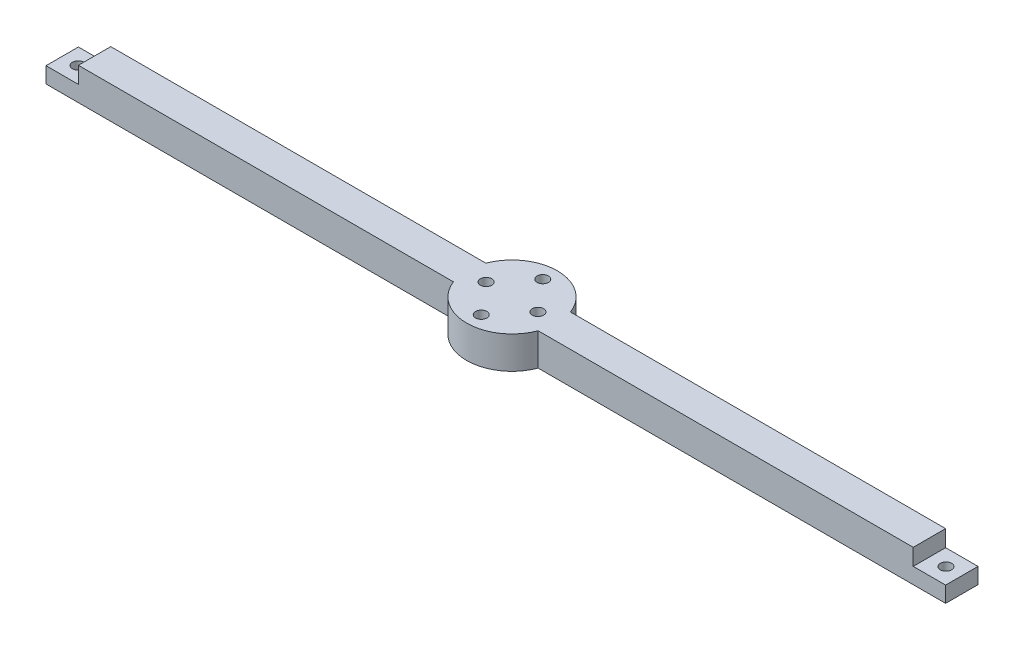
ISO-10303-21;
HEADER;
FILE_DESCRIPTION(('STEP AP214'),'2;1');
FILE_NAME('part.step','',(''),(''),'','','');
FILE_SCHEMA(('AUTOMOTIVE_DESIGN { 1 0 10303 214 1 1 1 1 }'));
ENDSEC;
DATA;
#1=APPLICATION_CONTEXT('core data for automotive mechanical design processes');
#2=APPLICATION_PROTOCOL_DEFINITION('international standard','automotive_design',2000,#1);
#3=PRODUCT_CONTEXT('',#1,'mechanical');
#4=PRODUCT('Part','Part','',(#3));
#5=PRODUCT_RELATED_PRODUCT_CATEGORY('part','',(#4));
#6=PRODUCT_DEFINITION_FORMATION('','',#4);
#7=PRODUCT_DEFINITION_CONTEXT('part definition',#1,'design');
#8=PRODUCT_DEFINITION('design','',#6,#7);
#9=PRODUCT_DEFINITION_SHAPE('','',#8);
#10=(LENGTH_UNIT() NAMED_UNIT(*) SI_UNIT(.MILLI.,.METRE.));
#11=(NAMED_UNIT(*) PLANE_ANGLE_UNIT() SI_UNIT($,.RADIAN.));
#12=(NAMED_UNIT(*) SI_UNIT($,.STERADIAN.) SOLID_ANGLE_UNIT());
#13=UNCERTAINTY_MEASURE_WITH_UNIT(LENGTH_MEASURE(1.E-05),#10,'distance_accuracy_value','');
#14=(GEOMETRIC_REPRESENTATION_CONTEXT(3) GLOBAL_UNCERTAINTY_ASSIGNED_CONTEXT((#13)) GLOBAL_UNIT_ASSIGNED_CONTEXT((#10,
#11,#12)) REPRESENTATION_CONTEXT('',''));
#15=CARTESIAN_POINT('',(0.,0.,0.));
#16=DIRECTION('',(0.,0.,1.));
#17=DIRECTION('',(1.,0.,0.));
#18=AXIS2_PLACEMENT_3D('',#15,#16,#17);
#19=CARTESIAN_POINT('',(0.,10.,0.));
#20=DIRECTION('',(0.,-1.,0.));
#21=DIRECTION('',(0.,0.,-1.));
#22=AXIS2_PLACEMENT_3D('',#19,#20,#21);
#23=CYLINDRICAL_SURFACE('',#22,14.);
#24=CARTESIAN_POINT('',(0.,0.,0.));
#25=DIRECTION('',(0.,1.,0.));
#26=DIRECTION('',(0.,0.,1.));
#27=AXIS2_PLACEMENT_3D('',#24,#25,#26);
#28=CIRCLE('',#27,14.);
#29=CARTESIAN_POINT('',(13.076696830622,0.,-5.));
#30=VERTEX_POINT('',#29);
#31=CARTESIAN_POINT('',(-13.076696830622,0.,-5.));
#32=VERTEX_POINT('',#31);
#33=EDGE_CURVE('E231',#30,#32,#28,.T.);
#34=ORIENTED_EDGE('',*,*,#33,.T.);
#35=DIRECTION('',(0.,1.,0.));
#36=VECTOR('',#35,1.);
#37=CARTESIAN_POINT('',(-13.076696830622,-136.29066125188,-5.));
#38=LINE('',#37,#36);
#39=CARTESIAN_POINT('',(-13.076696830622,10.,-5.));
#40=VERTEX_POINT('',#39);
#41=EDGE_CURVE('E158',#32,#40,#38,.T.);
#42=ORIENTED_EDGE('',*,*,#41,.T.);
#43=CARTESIAN_POINT('',(0.,10.,0.));
#44=DIRECTION('',(0.,1.,0.));
#45=DIRECTION('',(0.,0.,1.));
#46=AXIS2_PLACEMENT_3D('',#43,#44,#45);
#47=CIRCLE('',#46,14.);
#48=CARTESIAN_POINT('',(13.076696830622,10.,-5.));
#49=VERTEX_POINT('',#48);
#50=EDGE_CURVE('E151',#49,#40,#47,.T.);
#51=ORIENTED_EDGE('',*,*,#50,.F.);
#52=DIRECTION('',(0.,1.,0.));
#53=VECTOR('',#52,1.);
#54=CARTESIAN_POINT('',(13.076696830622,-136.29066125188,-5.));
#55=LINE('',#54,#53);
#56=EDGE_CURVE('E216',#30,#49,#55,.T.);
#57=ORIENTED_EDGE('',*,*,#56,.F.);
#58=EDGE_LOOP('',(#34,#42,#51,#57));
#59=FACE_BOUND('',#58,.T.);
#60=ADVANCED_FACE('F39',(#59),#23,.T.);
#61=CARTESIAN_POINT('',(-13.076696830622,10.,5.));
#62=VERTEX_POINT('',#61);
#63=CARTESIAN_POINT('',(13.076696830622,10.,5.));
#64=VERTEX_POINT('',#63);
#65=EDGE_CURVE('E230',#62,#64,#47,.T.);
#66=ORIENTED_EDGE('',*,*,#65,.F.);
#67=DIRECTION('',(0.,1.,0.));
#68=VECTOR('',#67,1.);
#69=CARTESIAN_POINT('',(-13.076696830622,-136.29066125188,5.));
#70=LINE('',#69,#68);
#71=CARTESIAN_POINT('',(-13.076696830622,0.,5.));
#72=VERTEX_POINT('',#71);
#73=EDGE_CURVE('E153',#72,#62,#70,.T.);
#74=ORIENTED_EDGE('',*,*,#73,.F.);
#75=CARTESIAN_POINT('',(13.076696830622,0.,5.));
#76=VERTEX_POINT('',#75);
#77=EDGE_CURVE('E226',#72,#76,#28,.T.);
#78=ORIENTED_EDGE('',*,*,#77,.T.);
#79=DIRECTION('',(0.,1.,0.));
#80=VECTOR('',#79,1.);
#81=CARTESIAN_POINT('',(13.076696830622,-136.29066125188,5.));
#82=LINE('',#81,#80);
#83=EDGE_CURVE('E209',#76,#64,#82,.T.);
#84=ORIENTED_EDGE('',*,*,#83,.T.);
#85=EDGE_LOOP('',(#66,#74,#78,#84));
#86=FACE_BOUND('',#85,.T.);
#87=ADVANCED_FACE('F41',(#86),#23,.T.);
#88=CARTESIAN_POINT('',(0.,10.,0.));
#89=DIRECTION('',(0.,1.,0.));
#90=DIRECTION('',(0.,0.,1.));
#91=AXIS2_PLACEMENT_3D('',#88,#89,#90);
#92=PLANE('',#91);
#93=CARTESIAN_POINT('',(0.,10.,-9.5));
#94=DIRECTION('',(0.,1.,0.));
#95=DIRECTION('',(0.,0.,1.));
#96=AXIS2_PLACEMENT_3D('',#93,#94,#95);
#97=CIRCLE('',#96,1.75);
#98=CARTESIAN_POINT('',(0.,10.,-7.75));
#99=VERTEX_POINT('',#98);
#100=EDGE_CURVE('E309',#99,#99,#97,.T.);
#101=ORIENTED_EDGE('',*,*,#100,.F.);
#102=EDGE_LOOP('',(#101));
#103=FACE_BOUND('',#102,.T.);
#104=CARTESIAN_POINT('',(8.,10.,0.));
#105=DIRECTION('',(0.,1.,0.));
#106=DIRECTION('',(0.,0.,1.));
#107=AXIS2_PLACEMENT_3D('',#104,#105,#106);
#108=CIRCLE('',#107,1.75);
#109=CARTESIAN_POINT('',(8.,10.,1.75));
#110=VERTEX_POINT('',#109);
#111=EDGE_CURVE('E301',#110,#110,#108,.T.);
#112=ORIENTED_EDGE('',*,*,#111,.F.);
#113=EDGE_LOOP('',(#112));
#114=FACE_BOUND('',#113,.T.);
#115=CARTESIAN_POINT('',(-8.,10.,0.));
#116=DIRECTION('',(0.,1.,0.));
#117=DIRECTION('',(0.,0.,1.));
#118=AXIS2_PLACEMENT_3D('',#115,#116,#117);
#119=CIRCLE('',#118,1.75);
#120=CARTESIAN_POINT('',(-8.,10.,1.75));
#121=VERTEX_POINT('',#120);
#122=EDGE_CURVE('E293',#121,#121,#119,.T.);
#123=ORIENTED_EDGE('',*,*,#122,.F.);
#124=EDGE_LOOP('',(#123));
#125=FACE_BOUND('',#124,.T.);
#126=CARTESIAN_POINT('',(0.,10.,9.5));
#127=DIRECTION('',(0.,1.,0.));
#128=DIRECTION('',(0.,0.,1.));
#129=AXIS2_PLACEMENT_3D('',#126,#127,#128);
#130=CIRCLE('',#129,1.75);
#131=CARTESIAN_POINT('',(0.,10.,11.25));
#132=VERTEX_POINT('',#131);
#133=EDGE_CURVE('E284',#132,#132,#130,.T.);
#134=ORIENTED_EDGE('',*,*,#133,.F.);
#135=EDGE_LOOP('',(#134));
#136=FACE_BOUND('',#135,.T.);
#137=DIRECTION('',(0.,0.,-1.));
#138=VECTOR('',#137,1.);
#139=CARTESIAN_POINT('',(-128.9,10.,14.));
#140=LINE('',#139,#138);
#141=CARTESIAN_POINT('',(-128.9,10.,5.));
#142=VERTEX_POINT('',#141);
#143=CARTESIAN_POINT('',(-128.9,10.,-5.));
#144=VERTEX_POINT('',#143);
#145=EDGE_CURVE('E126',#142,#144,#140,.T.);
#146=ORIENTED_EDGE('',*,*,#145,.F.);
#147=DIRECTION('',(1.,0.,0.));
#148=VECTOR('',#147,1.);
#149=CARTESIAN_POINT('',(-13.076696830622,10.,5.));
#150=LINE('',#149,#148);
#151=EDGE_CURVE('E63',#142,#62,#150,.T.);
#152=ORIENTED_EDGE('',*,*,#151,.T.);
#153=ORIENTED_EDGE('',*,*,#65,.T.);
#154=DIRECTION('',(1.,0.,0.));
#155=VECTOR('',#154,1.);
#156=CARTESIAN_POINT('',(13.076696830622,10.,5.));
#157=LINE('',#156,#155);
#158=CARTESIAN_POINT('',(128.9,10.,5.));
#159=VERTEX_POINT('',#158);
#160=EDGE_CURVE('E212',#64,#159,#157,.T.);
#161=ORIENTED_EDGE('',*,*,#160,.T.);
#162=DIRECTION('',(0.,0.,1.));
#163=VECTOR('',#162,1.);
#164=CARTESIAN_POINT('',(128.9,10.,-14.));
#165=LINE('',#164,#163);
#166=CARTESIAN_POINT('',(128.9,10.,-5.));
#167=VERTEX_POINT('',#166);
#168=EDGE_CURVE('E190',#167,#159,#165,.T.);
#169=ORIENTED_EDGE('',*,*,#168,.F.);
#170=DIRECTION('',(-1.,0.,0.));
#171=VECTOR('',#170,1.);
#172=CARTESIAN_POINT('',(13.076696830622,10.,-5.));
#173=LINE('',#172,#171);
#174=EDGE_CURVE('E195',#167,#49,#173,.T.);
#175=ORIENTED_EDGE('',*,*,#174,.T.);
#176=ORIENTED_EDGE('',*,*,#50,.T.);
#177=DIRECTION('',(-1.,0.,0.));
#178=VECTOR('',#177,1.);
#179=CARTESIAN_POINT('',(-13.076696830622,10.,-5.));
#180=LINE('',#179,#178);
#181=EDGE_CURVE('E142',#40,#144,#180,.T.);
#182=ORIENTED_EDGE('',*,*,#181,.T.);
#183=EDGE_LOOP('',(#146,#152,#153,#161,#169,#175,#176,#182));
#184=FACE_BOUND('',#183,.T.);
#185=ADVANCED_FACE('F149',(#103,#114,#125,#136,#184),#92,.T.);
#186=CARTESIAN_POINT('',(0.,0.,0.));
#187=DIRECTION('',(0.,1.,0.));
#188=DIRECTION('',(0.,0.,1.));
#189=AXIS2_PLACEMENT_3D('',#186,#187,#188);
#190=PLANE('',#189);
#191=CARTESIAN_POINT('',(0.,0.,0.));
#192=DIRECTION('',(0.,-1.,0.));
#193=DIRECTION('',(0.,0.,-1.));
#194=AXIS2_PLACEMENT_3D('',#191,#192,#193);
#195=CIRCLE('',#194,4.75);
#196=CARTESIAN_POINT('',(0.,0.,-4.75));
#197=VERTEX_POINT('',#196);
#198=EDGE_CURVE('E316',#197,#197,#195,.T.);
#199=ORIENTED_EDGE('',*,*,#198,.F.);
#200=EDGE_LOOP('',(#199));
#201=FACE_BOUND('',#200,.T.);
#202=CARTESIAN_POINT('',(0.,0.,-9.5));
#203=DIRECTION('',(0.,1.,0.));
#204=DIRECTION('',(0.,0.,1.));
#205=AXIS2_PLACEMENT_3D('',#202,#203,#204);
#206=CIRCLE('',#205,1.75);
#207=CARTESIAN_POINT('',(0.,0.,-7.75));
#208=VERTEX_POINT('',#207);
#209=EDGE_CURVE('E283',#208,#208,#206,.T.);
#210=ORIENTED_EDGE('',*,*,#209,.T.);
#211=EDGE_LOOP('',(#210));
#212=FACE_BOUND('',#211,.T.);
#213=CARTESIAN_POINT('',(8.,0.,0.));
#214=DIRECTION('',(0.,1.,0.));
#215=DIRECTION('',(0.,0.,1.));
#216=AXIS2_PLACEMENT_3D('',#213,#214,#215);
#217=CIRCLE('',#216,1.75);
#218=CARTESIAN_POINT('',(8.,0.,1.75));
#219=VERTEX_POINT('',#218);
#220=EDGE_CURVE('E305',#219,#219,#217,.T.);
#221=ORIENTED_EDGE('',*,*,#220,.T.);
#222=EDGE_LOOP('',(#221));
#223=FACE_BOUND('',#222,.T.);
#224=CARTESIAN_POINT('',(-8.,0.,0.));
#225=DIRECTION('',(0.,1.,0.));
#226=DIRECTION('',(0.,0.,1.));
#227=AXIS2_PLACEMENT_3D('',#224,#225,#226);
#228=CIRCLE('',#227,1.75);
#229=CARTESIAN_POINT('',(-8.,0.,1.75));
#230=VERTEX_POINT('',#229);
#231=EDGE_CURVE('E297',#230,#230,#228,.T.);
#232=ORIENTED_EDGE('',*,*,#231,.T.);
#233=EDGE_LOOP('',(#232));
#234=FACE_BOUND('',#233,.T.);
#235=CARTESIAN_POINT('',(0.,0.,9.5));
#236=DIRECTION('',(0.,1.,0.));
#237=DIRECTION('',(0.,0.,1.));
#238=AXIS2_PLACEMENT_3D('',#235,#236,#237);
#239=CIRCLE('',#238,1.75);
#240=CARTESIAN_POINT('',(0.,0.,11.25));
#241=VERTEX_POINT('',#240);
#242=EDGE_CURVE('E288',#241,#241,#239,.T.);
#243=ORIENTED_EDGE('',*,*,#242,.T.);
#244=EDGE_LOOP('',(#243));
#245=FACE_BOUND('',#244,.T.);
#246=CARTESIAN_POINT('',(-134.,0.,0.));
#247=DIRECTION('',(0.,1.,0.));
#248=DIRECTION('',(0.,0.,1.));
#249=AXIS2_PLACEMENT_3D('',#246,#247,#248);
#250=CIRCLE('',#249,1.75000000000001);
#251=CARTESIAN_POINT('',(-134.,0.,1.75000000000001));
#252=VERTEX_POINT('',#251);
#253=EDGE_CURVE('E146',#252,#252,#250,.T.);
#254=ORIENTED_EDGE('',*,*,#253,.T.);
#255=EDGE_LOOP('',(#254));
#256=FACE_BOUND('',#255,.T.);
#257=CARTESIAN_POINT('',(134.,0.,0.));
#258=DIRECTION('',(0.,1.,0.));
#259=DIRECTION('',(0.,0.,1.));
#260=AXIS2_PLACEMENT_3D('',#257,#258,#259);
#261=CIRCLE('',#260,1.75000000000001);
#262=CARTESIAN_POINT('',(134.,0.,1.75000000000001));
#263=VERTEX_POINT('',#262);
#264=EDGE_CURVE('E175',#263,#263,#261,.T.);
#265=ORIENTED_EDGE('',*,*,#264,.T.);
#266=EDGE_LOOP('',(#265));
#267=FACE_BOUND('',#266,.T.);
#268=DIRECTION('',(-1.,0.,0.));
#269=VECTOR('',#268,1.);
#270=CARTESIAN_POINT('',(-13.076696830622,0.,5.));
#271=LINE('',#270,#269);
#272=CARTESIAN_POINT('',(-138.9,0.,5.));
#273=VERTEX_POINT('',#272);
#274=EDGE_CURVE('E167',#72,#273,#271,.T.);
#275=ORIENTED_EDGE('',*,*,#274,.T.);
#276=DIRECTION('',(0.,0.,-1.));
#277=VECTOR('',#276,1.);
#278=CARTESIAN_POINT('',(-138.9,0.,14.));
#279=LINE('',#278,#277);
#280=CARTESIAN_POINT('',(-138.9,0.,-5.));
#281=VERTEX_POINT('',#280);
#282=EDGE_CURVE('E160',#273,#281,#279,.T.);
#283=ORIENTED_EDGE('',*,*,#282,.T.);
#284=DIRECTION('',(1.,0.,0.));
#285=VECTOR('',#284,1.);
#286=CARTESIAN_POINT('',(-13.076696830622,0.,-5.));
#287=LINE('',#286,#285);
#288=EDGE_CURVE('E165',#281,#32,#287,.T.);
#289=ORIENTED_EDGE('',*,*,#288,.T.);
#290=ORIENTED_EDGE('',*,*,#33,.F.);
#291=DIRECTION('',(1.,0.,0.));
#292=VECTOR('',#291,1.);
#293=CARTESIAN_POINT('',(13.076696830622,0.,-5.));
#294=LINE('',#293,#292);
#295=CARTESIAN_POINT('',(138.9,0.,-5.));
#296=VERTEX_POINT('',#295);
#297=EDGE_CURVE('E208',#30,#296,#294,.T.);
#298=ORIENTED_EDGE('',*,*,#297,.T.);
#299=DIRECTION('',(0.,0.,1.));
#300=VECTOR('',#299,1.);
#301=CARTESIAN_POINT('',(138.9,0.,-14.));
#302=LINE('',#301,#300);
#303=CARTESIAN_POINT('',(138.9,0.,5.));
#304=VERTEX_POINT('',#303);
#305=EDGE_CURVE('E191',#296,#304,#302,.T.);
#306=ORIENTED_EDGE('',*,*,#305,.T.);
#307=DIRECTION('',(-1.,0.,0.));
#308=VECTOR('',#307,1.);
#309=CARTESIAN_POINT('',(13.076696830622,0.,5.));
#310=LINE('',#309,#308);
#311=EDGE_CURVE('E204',#304,#76,#310,.T.);
#312=ORIENTED_EDGE('',*,*,#311,.T.);
#313=ORIENTED_EDGE('',*,*,#77,.F.);
#314=EDGE_LOOP('',(#275,#283,#289,#290,#298,#306,#312,#313));
#315=FACE_BOUND('',#314,.T.);
#316=ADVANCED_FACE('F333',(#201,#212,#223,#234,#245,#256,#267,#315),#190,.F.);
#317=CARTESIAN_POINT('',(13.076696830622,-136.29066125188,5.));
#318=DIRECTION('',(0.,0.,1.));
#319=DIRECTION('',(1.,0.,0.));
#320=AXIS2_PLACEMENT_3D('',#317,#318,#319);
#321=PLANE('',#320);
#322=DIRECTION('',(0.,-1.,0.));
#323=VECTOR('',#322,1.);
#324=CARTESIAN_POINT('',(138.9,0.,5.));
#325=LINE('',#324,#323);
#326=CARTESIAN_POINT('',(138.9,4.9,5.));
#327=VERTEX_POINT('',#326);
#328=EDGE_CURVE('E187',#327,#304,#325,.T.);
#329=ORIENTED_EDGE('',*,*,#328,.F.);
#330=DIRECTION('',(1.,0.,0.));
#331=VECTOR('',#330,1.);
#332=CARTESIAN_POINT('',(138.9,4.9,5.));
#333=LINE('',#332,#331);
#334=CARTESIAN_POINT('',(128.9,4.9,5.));
#335=VERTEX_POINT('',#334);
#336=EDGE_CURVE('E183',#335,#327,#333,.T.);
#337=ORIENTED_EDGE('',*,*,#336,.F.);
#338=DIRECTION('',(0.,-1.,0.));
#339=VECTOR('',#338,1.);
#340=CARTESIAN_POINT('',(128.9,4.9,5.));
#341=LINE('',#340,#339);
#342=EDGE_CURVE('E179',#159,#335,#341,.T.);
#343=ORIENTED_EDGE('',*,*,#342,.F.);
#344=ORIENTED_EDGE('',*,*,#160,.F.);
#345=ORIENTED_EDGE('',*,*,#83,.F.);
#346=ORIENTED_EDGE('',*,*,#311,.F.);
#347=EDGE_LOOP('',(#329,#337,#343,#344,#345,#346));
#348=FACE_BOUND('',#347,.T.);
#349=ADVANCED_FACE('F336',(#348),#321,.T.);
#350=CARTESIAN_POINT('',(13.076696830622,-136.29066125188,-5.));
#351=DIRECTION('',(0.,0.,-1.));
#352=DIRECTION('',(-1.,0.,0.));
#353=AXIS2_PLACEMENT_3D('',#350,#351,#352);
#354=PLANE('',#353);
#355=DIRECTION('',(0.,1.,0.));
#356=VECTOR('',#355,1.);
#357=CARTESIAN_POINT('',(138.9,-136.29066125188,-5.));
#358=LINE('',#357,#356);
#359=CARTESIAN_POINT('',(138.9,4.9,-5.));
#360=VERTEX_POINT('',#359);
#361=EDGE_CURVE('E241',#296,#360,#358,.T.);
#362=ORIENTED_EDGE('',*,*,#361,.F.);
#363=ORIENTED_EDGE('',*,*,#297,.F.);
#364=ORIENTED_EDGE('',*,*,#56,.T.);
#365=ORIENTED_EDGE('',*,*,#174,.F.);
#366=DIRECTION('',(0.,1.,0.));
#367=VECTOR('',#366,1.);
#368=CARTESIAN_POINT('',(128.9,-136.29066125188,-5.));
#369=LINE('',#368,#367);
#370=CARTESIAN_POINT('',(128.9,4.89999999999999,-5.));
#371=VERTEX_POINT('',#370);
#372=EDGE_CURVE('E229',#371,#167,#369,.T.);
#373=ORIENTED_EDGE('',*,*,#372,.F.);
#374=DIRECTION('',(-1.,0.,0.));
#375=VECTOR('',#374,1.);
#376=CARTESIAN_POINT('',(13.076696830622,4.89999999999999,-5.));
#377=LINE('',#376,#375);
#378=EDGE_CURVE('E237',#360,#371,#377,.T.);
#379=ORIENTED_EDGE('',*,*,#378,.F.);
#380=EDGE_LOOP('',(#362,#363,#364,#365,#373,#379));
#381=FACE_BOUND('',#380,.T.);
#382=ADVANCED_FACE('F359',(#381),#354,.T.);
#383=CARTESIAN_POINT('',(138.9,0.,-14.));
#384=DIRECTION('',(-1.,0.,0.));
#385=DIRECTION('',(0.,0.,1.));
#386=AXIS2_PLACEMENT_3D('',#383,#384,#385);
#387=PLANE('',#386);
#388=ORIENTED_EDGE('',*,*,#361,.T.);
#389=DIRECTION('',(0.,0.,1.));
#390=VECTOR('',#389,1.);
#391=CARTESIAN_POINT('',(138.9,4.9,-14.));
#392=LINE('',#391,#390);
#393=EDGE_CURVE('E196',#360,#327,#392,.T.);
#394=ORIENTED_EDGE('',*,*,#393,.T.);
#395=ORIENTED_EDGE('',*,*,#328,.T.);
#396=ORIENTED_EDGE('',*,*,#305,.F.);
#397=EDGE_LOOP('',(#388,#394,#395,#396));
#398=FACE_BOUND('',#397,.T.);
#399=ADVANCED_FACE('F392',(#398),#387,.F.);
#400=CARTESIAN_POINT('',(138.9,4.9,-14.));
#401=DIRECTION('',(0.,-1.,0.));
#402=DIRECTION('',(0.,0.,-1.));
#403=AXIS2_PLACEMENT_3D('',#400,#401,#402);
#404=PLANE('',#403);
#405=CARTESIAN_POINT('',(134.,4.9,0.));
#406=DIRECTION('',(0.,1.,0.));
#407=DIRECTION('',(0.,0.,1.));
#408=AXIS2_PLACEMENT_3D('',#405,#406,#407);
#409=CIRCLE('',#408,1.75000000000001);
#410=CARTESIAN_POINT('',(134.,4.9,1.75000000000001));
#411=VERTEX_POINT('',#410);
#412=EDGE_CURVE('E171',#411,#411,#409,.T.);
#413=ORIENTED_EDGE('',*,*,#412,.F.);
#414=EDGE_LOOP('',(#413));
#415=FACE_BOUND('',#414,.T.);
#416=ORIENTED_EDGE('',*,*,#378,.T.);
#417=DIRECTION('',(0.,0.,1.));
#418=VECTOR('',#417,1.);
#419=CARTESIAN_POINT('',(128.9,4.9,-14.));
#420=LINE('',#419,#418);
#421=EDGE_CURVE('E199',#371,#335,#420,.T.);
#422=ORIENTED_EDGE('',*,*,#421,.T.);
#423=ORIENTED_EDGE('',*,*,#336,.T.);
#424=ORIENTED_EDGE('',*,*,#393,.F.);
#425=EDGE_LOOP('',(#416,#422,#423,#424));
#426=FACE_BOUND('',#425,.T.);
#427=ADVANCED_FACE('F399',(#415,#426),#404,.F.);
#428=CARTESIAN_POINT('',(128.9,4.9,-14.));
#429=DIRECTION('',(-1.,0.,0.));
#430=DIRECTION('',(0.,0.,1.));
#431=AXIS2_PLACEMENT_3D('',#428,#429,#430);
#432=PLANE('',#431);
#433=ORIENTED_EDGE('',*,*,#372,.T.);
#434=ORIENTED_EDGE('',*,*,#168,.T.);
#435=ORIENTED_EDGE('',*,*,#342,.T.);
#436=ORIENTED_EDGE('',*,*,#421,.F.);
#437=EDGE_LOOP('',(#433,#434,#435,#436));
#438=FACE_BOUND('',#437,.T.);
#439=ADVANCED_FACE('F395',(#438),#432,.F.);
#440=CARTESIAN_POINT('',(134.,-5.1,0.));
#441=DIRECTION('',(0.,1.,0.));
#442=DIRECTION('',(0.,0.,1.));
#443=AXIS2_PLACEMENT_3D('',#440,#441,#442);
#444=CYLINDRICAL_SURFACE('',#443,1.75000000000001);
#445=ORIENTED_EDGE('',*,*,#412,.T.);
#446=EDGE_LOOP('',(#445));
#447=FACE_BOUND('',#446,.T.);
#448=ORIENTED_EDGE('',*,*,#264,.F.);
#449=EDGE_LOOP('',(#448));
#450=FACE_BOUND('',#449,.T.);
#451=ADVANCED_FACE('F398',(#447,#450),#444,.F.);
#452=CARTESIAN_POINT('',(-13.076696830622,-136.29066125188,-5.));
#453=DIRECTION('',(0.,0.,-1.));
#454=DIRECTION('',(-1.,0.,0.));
#455=AXIS2_PLACEMENT_3D('',#452,#453,#454);
#456=PLANE('',#455);
#457=DIRECTION('',(0.,-1.,0.));
#458=VECTOR('',#457,1.);
#459=CARTESIAN_POINT('',(-138.9,0.,-5.));
#460=LINE('',#459,#458);
#461=CARTESIAN_POINT('',(-138.9,4.9,-5.));
#462=VERTEX_POINT('',#461);
#463=EDGE_CURVE('E135',#462,#281,#460,.T.);
#464=ORIENTED_EDGE('',*,*,#463,.F.);
#465=DIRECTION('',(-1.,0.,0.));
#466=VECTOR('',#465,1.);
#467=CARTESIAN_POINT('',(-138.9,4.9,-5.));
#468=LINE('',#467,#466);
#469=CARTESIAN_POINT('',(-128.9,4.9,-5.));
#470=VERTEX_POINT('',#469);
#471=EDGE_CURVE('E144',#470,#462,#468,.T.);
#472=ORIENTED_EDGE('',*,*,#471,.F.);
#473=DIRECTION('',(0.,-1.,0.));
#474=VECTOR('',#473,1.);
#475=CARTESIAN_POINT('',(-128.9,4.9,-5.));
#476=LINE('',#475,#474);
#477=EDGE_CURVE('E129',#144,#470,#476,.T.);
#478=ORIENTED_EDGE('',*,*,#477,.F.);
#479=ORIENTED_EDGE('',*,*,#181,.F.);
#480=ORIENTED_EDGE('',*,*,#41,.F.);
#481=ORIENTED_EDGE('',*,*,#288,.F.);
#482=EDGE_LOOP('',(#464,#472,#478,#479,#480,#481));
#483=FACE_BOUND('',#482,.T.);
#484=ADVANCED_FACE('F140',(#483),#456,.T.);
#485=CARTESIAN_POINT('',(-13.076696830622,-136.29066125188,5.));
#486=DIRECTION('',(0.,0.,1.));
#487=DIRECTION('',(1.,0.,0.));
#488=AXIS2_PLACEMENT_3D('',#485,#486,#487);
#489=PLANE('',#488);
#490=DIRECTION('',(0.,1.,0.));
#491=VECTOR('',#490,1.);
#492=CARTESIAN_POINT('',(-138.9,-136.29066125188,5.));
#493=LINE('',#492,#491);
#494=CARTESIAN_POINT('',(-138.9,4.9,5.));
#495=VERTEX_POINT('',#494);
#496=EDGE_CURVE('E11',#273,#495,#493,.T.);
#497=ORIENTED_EDGE('',*,*,#496,.F.);
#498=ORIENTED_EDGE('',*,*,#274,.F.);
#499=ORIENTED_EDGE('',*,*,#73,.T.);
#500=ORIENTED_EDGE('',*,*,#151,.F.);
#501=DIRECTION('',(0.,1.,0.));
#502=VECTOR('',#501,1.);
#503=CARTESIAN_POINT('',(-128.9,-136.29066125188,5.));
#504=LINE('',#503,#502);
#505=CARTESIAN_POINT('',(-128.9,4.89999999999999,5.));
#506=VERTEX_POINT('',#505);
#507=EDGE_CURVE('E132',#506,#142,#504,.T.);
#508=ORIENTED_EDGE('',*,*,#507,.F.);
#509=DIRECTION('',(1.,0.,0.));
#510=VECTOR('',#509,1.);
#511=CARTESIAN_POINT('',(-13.076696830622,4.89999999999999,5.));
#512=LINE('',#511,#510);
#513=EDGE_CURVE('E48',#495,#506,#512,.T.);
#514=ORIENTED_EDGE('',*,*,#513,.F.);
#515=EDGE_LOOP('',(#497,#498,#499,#500,#508,#514));
#516=FACE_BOUND('',#515,.T.);
#517=ADVANCED_FACE('F253',(#516),#489,.T.);
#518=CARTESIAN_POINT('',(-138.9,0.,14.));
#519=DIRECTION('',(1.,0.,0.));
#520=DIRECTION('',(0.,0.,-1.));
#521=AXIS2_PLACEMENT_3D('',#518,#519,#520);
#522=PLANE('',#521);
#523=ORIENTED_EDGE('',*,*,#496,.T.);
#524=DIRECTION('',(0.,0.,-1.));
#525=VECTOR('',#524,1.);
#526=CARTESIAN_POINT('',(-138.9,4.9,14.));
#527=LINE('',#526,#525);
#528=EDGE_CURVE('E250',#495,#462,#527,.T.);
#529=ORIENTED_EDGE('',*,*,#528,.T.);
#530=ORIENTED_EDGE('',*,*,#463,.T.);
#531=ORIENTED_EDGE('',*,*,#282,.F.);
#532=EDGE_LOOP('',(#523,#529,#530,#531));
#533=FACE_BOUND('',#532,.T.);
#534=ADVANCED_FACE('F365',(#533),#522,.F.);
#535=CARTESIAN_POINT('',(-138.9,4.9,14.));
#536=DIRECTION('',(0.,-1.,0.));
#537=DIRECTION('',(0.,0.,-1.));
#538=AXIS2_PLACEMENT_3D('',#535,#536,#537);
#539=PLANE('',#538);
#540=CARTESIAN_POINT('',(-134.,4.9,0.));
#541=DIRECTION('',(0.,1.,0.));
#542=DIRECTION('',(0.,0.,-1.));
#543=AXIS2_PLACEMENT_3D('',#540,#541,#542);
#544=CIRCLE('',#543,1.75000000000001);
#545=CARTESIAN_POINT('',(-134.,4.9,-1.75000000000001));
#546=VERTEX_POINT('',#545);
#547=EDGE_CURVE('E279',#546,#546,#544,.T.);
#548=ORIENTED_EDGE('',*,*,#547,.F.);
#549=EDGE_LOOP('',(#548));
#550=FACE_BOUND('',#549,.T.);
#551=ORIENTED_EDGE('',*,*,#513,.T.);
#552=DIRECTION('',(0.,0.,-1.));
#553=VECTOR('',#552,1.);
#554=CARTESIAN_POINT('',(-128.9,4.9,14.));
#555=LINE('',#554,#553);
#556=EDGE_CURVE('E55',#506,#470,#555,.T.);
#557=ORIENTED_EDGE('',*,*,#556,.T.);
#558=ORIENTED_EDGE('',*,*,#471,.T.);
#559=ORIENTED_EDGE('',*,*,#528,.F.);
#560=EDGE_LOOP('',(#551,#557,#558,#559));
#561=FACE_BOUND('',#560,.T.);
#562=ADVANCED_FACE('F249',(#550,#561),#539,.F.);
#563=CARTESIAN_POINT('',(-128.9,4.9,14.));
#564=DIRECTION('',(1.,0.,0.));
#565=DIRECTION('',(0.,0.,-1.));
#566=AXIS2_PLACEMENT_3D('',#563,#564,#565);
#567=PLANE('',#566);
#568=ORIENTED_EDGE('',*,*,#507,.T.);
#569=ORIENTED_EDGE('',*,*,#145,.T.);
#570=ORIENTED_EDGE('',*,*,#477,.T.);
#571=ORIENTED_EDGE('',*,*,#556,.F.);
#572=EDGE_LOOP('',(#568,#569,#570,#571));
#573=FACE_BOUND('',#572,.T.);
#574=ADVANCED_FACE('F128',(#573),#567,.F.);
#575=CARTESIAN_POINT('',(-134.,-5.1,0.));
#576=DIRECTION('',(0.,1.,0.));
#577=DIRECTION('',(0.,0.,1.));
#578=AXIS2_PLACEMENT_3D('',#575,#576,#577);
#579=CYLINDRICAL_SURFACE('',#578,1.75000000000001);
#580=ORIENTED_EDGE('',*,*,#547,.T.);
#581=EDGE_LOOP('',(#580));
#582=FACE_BOUND('',#581,.T.);
#583=ORIENTED_EDGE('',*,*,#253,.F.);
#584=EDGE_LOOP('',(#583));
#585=FACE_BOUND('',#584,.T.);
#586=ADVANCED_FACE('F412',(#582,#585),#579,.F.);
#587=CARTESIAN_POINT('',(0.,0.,9.5));
#588=DIRECTION('',(0.,1.,0.));
#589=DIRECTION('',(0.,0.,1.));
#590=AXIS2_PLACEMENT_3D('',#587,#588,#589);
#591=CYLINDRICAL_SURFACE('',#590,1.75);
#592=ORIENTED_EDGE('',*,*,#242,.F.);
#593=EDGE_LOOP('',(#592));
#594=FACE_BOUND('',#593,.T.);
#595=ORIENTED_EDGE('',*,*,#133,.T.);
#596=EDGE_LOOP('',(#595));
#597=FACE_BOUND('',#596,.T.);
#598=ADVANCED_FACE('F416',(#594,#597),#591,.F.);
#599=CARTESIAN_POINT('',(-8.,0.,0.));
#600=DIRECTION('',(0.,1.,0.));
#601=DIRECTION('',(0.,0.,1.));
#602=AXIS2_PLACEMENT_3D('',#599,#600,#601);
#603=CYLINDRICAL_SURFACE('',#602,1.75);
#604=ORIENTED_EDGE('',*,*,#231,.F.);
#605=EDGE_LOOP('',(#604));
#606=FACE_BOUND('',#605,.T.);
#607=ORIENTED_EDGE('',*,*,#122,.T.);
#608=EDGE_LOOP('',(#607));
#609=FACE_BOUND('',#608,.T.);
#610=ADVANCED_FACE('F421',(#606,#609),#603,.F.);
#611=CARTESIAN_POINT('',(8.,0.,0.));
#612=DIRECTION('',(0.,1.,0.));
#613=DIRECTION('',(0.,0.,1.));
#614=AXIS2_PLACEMENT_3D('',#611,#612,#613);
#615=CYLINDRICAL_SURFACE('',#614,1.75);
#616=ORIENTED_EDGE('',*,*,#220,.F.);
#617=EDGE_LOOP('',(#616));
#618=FACE_BOUND('',#617,.T.);
#619=ORIENTED_EDGE('',*,*,#111,.T.);
#620=EDGE_LOOP('',(#619));
#621=FACE_BOUND('',#620,.T.);
#622=ADVANCED_FACE('F428',(#618,#621),#615,.F.);
#623=CARTESIAN_POINT('',(0.,0.,-9.5));
#624=DIRECTION('',(0.,1.,0.));
#625=DIRECTION('',(0.,0.,1.));
#626=AXIS2_PLACEMENT_3D('',#623,#624,#625);
#627=CYLINDRICAL_SURFACE('',#626,1.75);
#628=ORIENTED_EDGE('',*,*,#209,.F.);
#629=EDGE_LOOP('',(#628));
#630=FACE_BOUND('',#629,.T.);
#631=ORIENTED_EDGE('',*,*,#100,.T.);
#632=EDGE_LOOP('',(#631));
#633=FACE_BOUND('',#632,.T.);
#634=ADVANCED_FACE('F329',(#630,#633),#627,.F.);
#635=CARTESIAN_POINT('',(0.,4.,0.));
#636=DIRECTION('',(0.,-1.,0.));
#637=DIRECTION('',(0.,0.,-1.));
#638=AXIS2_PLACEMENT_3D('',#635,#636,#637);
#639=CYLINDRICAL_SURFACE('',#638,4.75);
#640=CARTESIAN_POINT('',(0.,4.,0.));
#641=DIRECTION('',(0.,-1.,0.));
#642=DIRECTION('',(0.,0.,-1.));
#643=AXIS2_PLACEMENT_3D('',#640,#641,#642);
#644=CIRCLE('',#643,4.75);
#645=CARTESIAN_POINT('',(0.,4.,-4.75));
#646=VERTEX_POINT('',#645);
#647=EDGE_CURVE('E289',#646,#646,#644,.T.);
#648=ORIENTED_EDGE('',*,*,#647,.F.);
#649=EDGE_LOOP('',(#648));
#650=FACE_BOUND('',#649,.T.);
#651=ORIENTED_EDGE('',*,*,#198,.T.);
#652=EDGE_LOOP('',(#651));
#653=FACE_BOUND('',#652,.T.);
#654=ADVANCED_FACE('F326',(#650,#653),#639,.F.);
#655=CARTESIAN_POINT('',(0.,4.,0.));
#656=DIRECTION('',(0.,-1.,0.));
#657=DIRECTION('',(0.,0.,-1.));
#658=AXIS2_PLACEMENT_3D('',#655,#656,#657);
#659=PLANE('',#658);
#660=ORIENTED_EDGE('',*,*,#647,.T.);
#661=EDGE_LOOP('',(#660));
#662=FACE_BOUND('',#661,.T.);
#663=ADVANCED_FACE('F324',(#662),#659,.T.);
#664=CLOSED_SHELL('',(#60,#87,#185,#316,#349,#382,#399,#427,#439,#451,#484,#517,#534,#562,#574,
#586,#598,#610,#622,#634,#654,#663));
#665=MANIFOLD_SOLID_BREP('B2',#664);
#666=ADVANCED_BREP_SHAPE_REPRESENTATION('',(#18,#665),#14);
#667=SHAPE_DEFINITION_REPRESENTATION(#9,#666);
ENDSEC;
END-ISO-10303-21;
